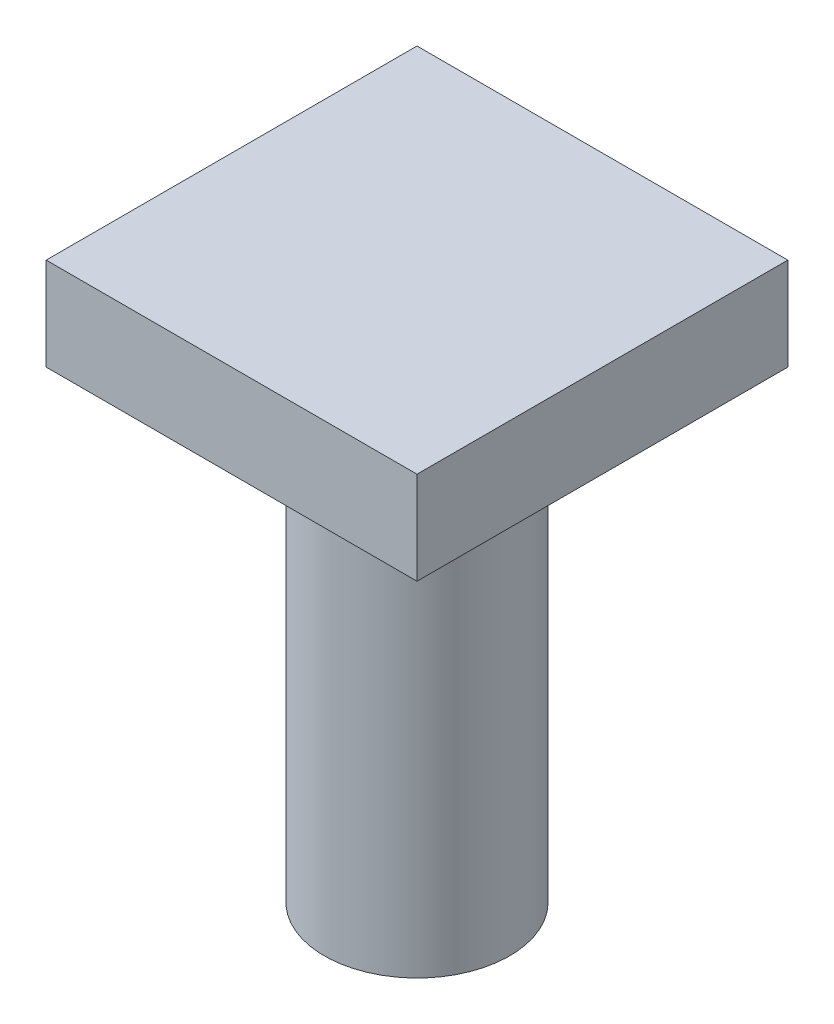
ISO-10303-21;
HEADER;
FILE_DESCRIPTION(('STEP AP214'),'2;1');
FILE_NAME('part.step','',(''),(''),'','','');
FILE_SCHEMA(('AUTOMOTIVE_DESIGN { 1 0 10303 214 1 1 1 1 }'));
ENDSEC;
DATA;
#1=APPLICATION_CONTEXT('core data for automotive mechanical design processes');
#2=APPLICATION_PROTOCOL_DEFINITION('international standard','automotive_design',2000,#1);
#3=PRODUCT_CONTEXT('',#1,'mechanical');
#4=PRODUCT('Part','Part','',(#3));
#5=PRODUCT_RELATED_PRODUCT_CATEGORY('part','',(#4));
#6=PRODUCT_DEFINITION_FORMATION('','',#4);
#7=PRODUCT_DEFINITION_CONTEXT('part definition',#1,'design');
#8=PRODUCT_DEFINITION('design','',#6,#7);
#9=PRODUCT_DEFINITION_SHAPE('','',#8);
#10=(LENGTH_UNIT() NAMED_UNIT(*) SI_UNIT(.MILLI.,.METRE.));
#11=(NAMED_UNIT(*) PLANE_ANGLE_UNIT() SI_UNIT($,.RADIAN.));
#12=(NAMED_UNIT(*) SI_UNIT($,.STERADIAN.) SOLID_ANGLE_UNIT());
#13=UNCERTAINTY_MEASURE_WITH_UNIT(LENGTH_MEASURE(1.E-05),#10,'distance_accuracy_value','');
#14=(GEOMETRIC_REPRESENTATION_CONTEXT(3) GLOBAL_UNCERTAINTY_ASSIGNED_CONTEXT((#13)) GLOBAL_UNIT_ASSIGNED_CONTEXT((#10,
#11,#12)) REPRESENTATION_CONTEXT('',''));
#15=CARTESIAN_POINT('',(0.,0.,0.));
#16=DIRECTION('',(0.,0.,1.));
#17=DIRECTION('',(1.,0.,0.));
#18=AXIS2_PLACEMENT_3D('',#15,#16,#17);
#19=CARTESIAN_POINT('',(10.,30.,-9.99999999999999));
#20=DIRECTION('',(-1.,0.,0.));
#21=DIRECTION('',(0.,0.,1.));
#22=AXIS2_PLACEMENT_3D('',#19,#20,#21);
#23=PLANE('',#22);
#24=DIRECTION('',(0.,0.,1.));
#25=VECTOR('',#24,1.);
#26=CARTESIAN_POINT('',(10.,25.,-9.99999999999999));
#27=LINE('',#26,#25);
#28=CARTESIAN_POINT('',(10.,25.,-9.99999999999999));
#29=VERTEX_POINT('',#28);
#30=CARTESIAN_POINT('',(10.,25.,10.));
#31=VERTEX_POINT('',#30);
#32=EDGE_CURVE('E51',#29,#31,#27,.T.);
#33=ORIENTED_EDGE('',*,*,#32,.F.);
#34=DIRECTION('',(0.,-1.,0.));
#35=VECTOR('',#34,1.);
#36=CARTESIAN_POINT('',(10.,30.,-9.99999999999999));
#37=LINE('',#36,#35);
#38=CARTESIAN_POINT('',(10.,30.,-9.99999999999999));
#39=VERTEX_POINT('',#38);
#40=EDGE_CURVE('E11',#39,#29,#37,.T.);
#41=ORIENTED_EDGE('',*,*,#40,.F.);
#42=DIRECTION('',(0.,0.,-1.));
#43=VECTOR('',#42,1.);
#44=CARTESIAN_POINT('',(10.,30.,-9.99999999999999));
#45=LINE('',#44,#43);
#46=CARTESIAN_POINT('',(10.,30.,10.));
#47=VERTEX_POINT('',#46);
#48=EDGE_CURVE('E96',#47,#39,#45,.T.);
#49=ORIENTED_EDGE('',*,*,#48,.F.);
#50=DIRECTION('',(0.,-1.,0.));
#51=VECTOR('',#50,1.);
#52=CARTESIAN_POINT('',(10.,30.,10.));
#53=LINE('',#52,#51);
#54=EDGE_CURVE('E89',#47,#31,#53,.T.);
#55=ORIENTED_EDGE('',*,*,#54,.T.);
#56=EDGE_LOOP('',(#33,#41,#49,#55));
#57=FACE_BOUND('',#56,.T.);
#58=ADVANCED_FACE('F37',(#57),#23,.F.);
#59=CARTESIAN_POINT('',(-10.,30.,-9.99999999999999));
#60=DIRECTION('',(0.,0.,1.));
#61=DIRECTION('',(1.,0.,0.));
#62=AXIS2_PLACEMENT_3D('',#59,#60,#61);
#63=PLANE('',#62);
#64=DIRECTION('',(1.,0.,0.));
#65=VECTOR('',#64,1.);
#66=CARTESIAN_POINT('',(-10.,25.,-9.99999999999999));
#67=LINE('',#66,#65);
#68=CARTESIAN_POINT('',(-10.,25.,-9.99999999999999));
#69=VERTEX_POINT('',#68);
#70=EDGE_CURVE('E76',#69,#29,#67,.T.);
#71=ORIENTED_EDGE('',*,*,#70,.F.);
#72=DIRECTION('',(0.,-1.,0.));
#73=VECTOR('',#72,1.);
#74=CARTESIAN_POINT('',(-10.,30.,-9.99999999999999));
#75=LINE('',#74,#73);
#76=CARTESIAN_POINT('',(-10.,30.,-9.99999999999999));
#77=VERTEX_POINT('',#76);
#78=EDGE_CURVE('E44',#77,#69,#75,.T.);
#79=ORIENTED_EDGE('',*,*,#78,.F.);
#80=DIRECTION('',(-1.,0.,0.));
#81=VECTOR('',#80,1.);
#82=CARTESIAN_POINT('',(-10.,30.,-9.99999999999999));
#83=LINE('',#82,#81);
#84=EDGE_CURVE('E93',#39,#77,#83,.T.);
#85=ORIENTED_EDGE('',*,*,#84,.F.);
#86=ORIENTED_EDGE('',*,*,#40,.T.);
#87=EDGE_LOOP('',(#71,#79,#85,#86));
#88=FACE_BOUND('',#87,.T.);
#89=ADVANCED_FACE('F92',(#88),#63,.F.);
#90=CARTESIAN_POINT('',(-10.,30.,-9.99999999999999));
#91=DIRECTION('',(1.,0.,0.));
#92=DIRECTION('',(0.,0.,-1.));
#93=AXIS2_PLACEMENT_3D('',#90,#91,#92);
#94=PLANE('',#93);
#95=DIRECTION('',(0.,0.,-1.));
#96=VECTOR('',#95,1.);
#97=CARTESIAN_POINT('',(-10.,25.,10.));
#98=LINE('',#97,#96);
#99=CARTESIAN_POINT('',(-10.,25.,10.));
#100=VERTEX_POINT('',#99);
#101=EDGE_CURVE('E79',#100,#69,#98,.T.);
#102=ORIENTED_EDGE('',*,*,#101,.F.);
#103=DIRECTION('',(0.,-1.,0.));
#104=VECTOR('',#103,1.);
#105=CARTESIAN_POINT('',(-10.,30.,10.));
#106=LINE('',#105,#104);
#107=CARTESIAN_POINT('',(-10.,30.,10.));
#108=VERTEX_POINT('',#107);
#109=EDGE_CURVE('E106',#108,#100,#106,.T.);
#110=ORIENTED_EDGE('',*,*,#109,.F.);
#111=DIRECTION('',(0.,0.,1.));
#112=VECTOR('',#111,1.);
#113=CARTESIAN_POINT('',(-10.,30.,-9.99999999999999));
#114=LINE('',#113,#112);
#115=EDGE_CURVE('E95',#77,#108,#114,.T.);
#116=ORIENTED_EDGE('',*,*,#115,.F.);
#117=ORIENTED_EDGE('',*,*,#78,.T.);
#118=EDGE_LOOP('',(#102,#110,#116,#117));
#119=FACE_BOUND('',#118,.T.);
#120=ADVANCED_FACE('F109',(#119),#94,.F.);
#121=CARTESIAN_POINT('',(-10.,30.,10.));
#122=DIRECTION('',(0.,0.,-1.));
#123=DIRECTION('',(-1.,0.,0.));
#124=AXIS2_PLACEMENT_3D('',#121,#122,#123);
#125=PLANE('',#124);
#126=DIRECTION('',(-1.,0.,0.));
#127=VECTOR('',#126,1.);
#128=CARTESIAN_POINT('',(10.,25.,10.));
#129=LINE('',#128,#127);
#130=EDGE_CURVE('E90',#31,#100,#129,.T.);
#131=ORIENTED_EDGE('',*,*,#130,.F.);
#132=ORIENTED_EDGE('',*,*,#54,.F.);
#133=DIRECTION('',(1.,0.,0.));
#134=VECTOR('',#133,1.);
#135=CARTESIAN_POINT('',(-10.,30.,10.));
#136=LINE('',#135,#134);
#137=EDGE_CURVE('E59',#108,#47,#136,.T.);
#138=ORIENTED_EDGE('',*,*,#137,.F.);
#139=ORIENTED_EDGE('',*,*,#109,.T.);
#140=EDGE_LOOP('',(#131,#132,#138,#139));
#141=FACE_BOUND('',#140,.T.);
#142=ADVANCED_FACE('F112',(#141),#125,.F.);
#143=CARTESIAN_POINT('',(0.,30.,0.));
#144=DIRECTION('',(0.,1.,0.));
#145=DIRECTION('',(0.,0.,1.));
#146=AXIS2_PLACEMENT_3D('',#143,#144,#145);
#147=PLANE('',#146);
#148=ORIENTED_EDGE('',*,*,#48,.T.);
#149=ORIENTED_EDGE('',*,*,#84,.T.);
#150=ORIENTED_EDGE('',*,*,#115,.T.);
#151=ORIENTED_EDGE('',*,*,#137,.T.);
#152=EDGE_LOOP('',(#148,#149,#150,#151));
#153=FACE_BOUND('',#152,.T.);
#154=ADVANCED_FACE('F98',(#153),#147,.T.);
#155=CARTESIAN_POINT('',(0.,25.,0.));
#156=DIRECTION('',(0.,-1.,0.));
#157=DIRECTION('',(0.,0.,-1.));
#158=AXIS2_PLACEMENT_3D('',#155,#156,#157);
#159=PLANE('',#158);
#160=CARTESIAN_POINT('',(0.,25.,0.));
#161=DIRECTION('',(0.,-1.,0.));
#162=DIRECTION('',(0.,0.,-1.));
#163=AXIS2_PLACEMENT_3D('',#160,#161,#162);
#164=CIRCLE('',#163,5.);
#165=CARTESIAN_POINT('',(0.,25.,-5.));
#166=VERTEX_POINT('',#165);
#167=EDGE_CURVE('E83',#166,#166,#164,.T.);
#168=ORIENTED_EDGE('',*,*,#167,.F.);
#169=EDGE_LOOP('',(#168));
#170=FACE_BOUND('',#169,.T.);
#171=ORIENTED_EDGE('',*,*,#70,.T.);
#172=ORIENTED_EDGE('',*,*,#32,.T.);
#173=ORIENTED_EDGE('',*,*,#130,.T.);
#174=ORIENTED_EDGE('',*,*,#101,.T.);
#175=EDGE_LOOP('',(#171,#172,#173,#174));
#176=FACE_BOUND('',#175,.T.);
#177=ADVANCED_FACE('F77',(#170,#176),#159,.T.);
#178=CARTESIAN_POINT('',(0.,25.,0.));
#179=DIRECTION('',(0.,-1.,0.));
#180=DIRECTION('',(0.,0.,-1.));
#181=AXIS2_PLACEMENT_3D('',#178,#179,#180);
#182=CYLINDRICAL_SURFACE('',#181,5.);
#183=ORIENTED_EDGE('',*,*,#167,.T.);
#184=EDGE_LOOP('',(#183));
#185=FACE_BOUND('',#184,.T.);
#186=CARTESIAN_POINT('',(0.,0.,0.));
#187=DIRECTION('',(0.,-1.,0.));
#188=DIRECTION('',(0.,0.,-1.));
#189=AXIS2_PLACEMENT_3D('',#186,#187,#188);
#190=CIRCLE('',#189,5.);
#191=CARTESIAN_POINT('',(0.,0.,-5.));
#192=VERTEX_POINT('',#191);
#193=EDGE_CURVE('E114',#192,#192,#190,.T.);
#194=ORIENTED_EDGE('',*,*,#193,.F.);
#195=EDGE_LOOP('',(#194));
#196=FACE_BOUND('',#195,.T.);
#197=ADVANCED_FACE('F120',(#185,#196),#182,.T.);
#198=CARTESIAN_POINT('',(0.,0.,0.));
#199=DIRECTION('',(0.,1.,0.));
#200=DIRECTION('',(0.,0.,1.));
#201=AXIS2_PLACEMENT_3D('',#198,#199,#200);
#202=PLANE('',#201);
#203=ORIENTED_EDGE('',*,*,#193,.T.);
#204=EDGE_LOOP('',(#203));
#205=FACE_BOUND('',#204,.T.);
#206=ADVANCED_FACE('F129',(#205),#202,.F.);
#207=CLOSED_SHELL('',(#58,#89,#120,#142,#154,#177,#197,#206));
#208=MANIFOLD_SOLID_BREP('B2',#207);
#209=ADVANCED_BREP_SHAPE_REPRESENTATION('',(#18,#208),#14);
#210=SHAPE_DEFINITION_REPRESENTATION(#9,#209);
ENDSEC;
END-ISO-10303-21;
